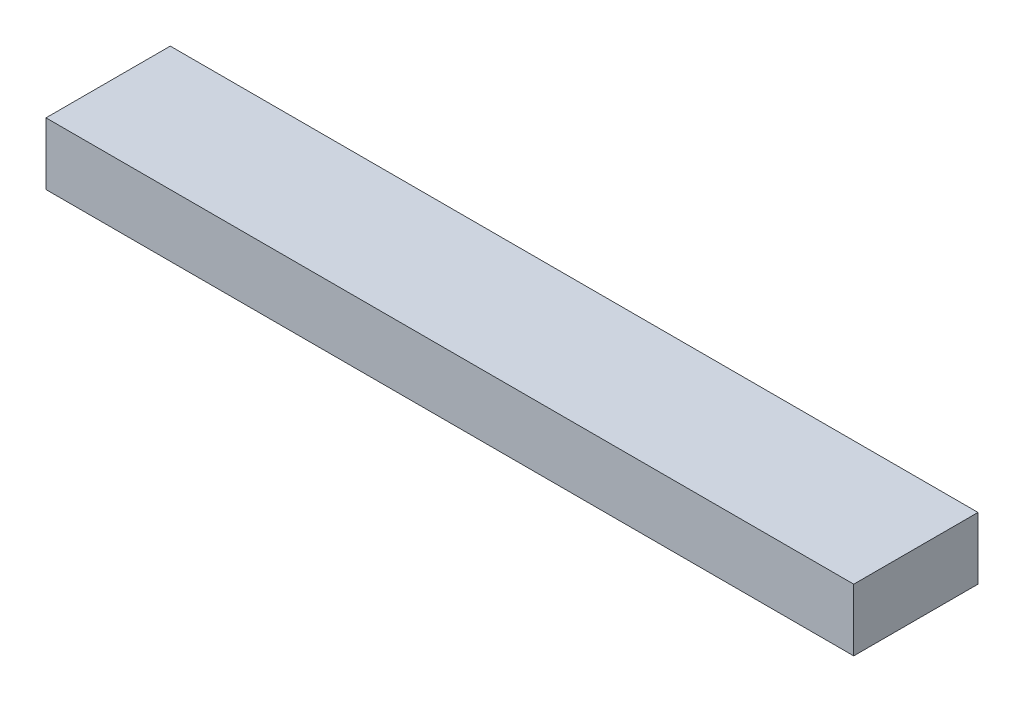
ISO-10303-21;
HEADER;
FILE_DESCRIPTION(('STEP AP214'),'2;1');
FILE_NAME('part.step','',(''),(''),'','','');
FILE_SCHEMA(('AUTOMOTIVE_DESIGN { 1 0 10303 214 1 1 1 1 }'));
ENDSEC;
DATA;
#1=APPLICATION_CONTEXT('core data for automotive mechanical design processes');
#2=APPLICATION_PROTOCOL_DEFINITION('international standard','automotive_design',2000,#1);
#3=PRODUCT_CONTEXT('',#1,'mechanical');
#4=PRODUCT('Part','Part','',(#3));
#5=PRODUCT_RELATED_PRODUCT_CATEGORY('part','',(#4));
#6=PRODUCT_DEFINITION_FORMATION('','',#4);
#7=PRODUCT_DEFINITION_CONTEXT('part definition',#1,'design');
#8=PRODUCT_DEFINITION('design','',#6,#7);
#9=PRODUCT_DEFINITION_SHAPE('','',#8);
#10=(LENGTH_UNIT() NAMED_UNIT(*) SI_UNIT(.MILLI.,.METRE.));
#11=(NAMED_UNIT(*) PLANE_ANGLE_UNIT() SI_UNIT($,.RADIAN.));
#12=(NAMED_UNIT(*) SI_UNIT($,.STERADIAN.) SOLID_ANGLE_UNIT());
#13=UNCERTAINTY_MEASURE_WITH_UNIT(LENGTH_MEASURE(1.E-05),#10,'distance_accuracy_value','');
#14=(GEOMETRIC_REPRESENTATION_CONTEXT(3) GLOBAL_UNCERTAINTY_ASSIGNED_CONTEXT((#13)) GLOBAL_UNIT_ASSIGNED_CONTEXT((#10,
#11,#12)) REPRESENTATION_CONTEXT('',''));
#15=CARTESIAN_POINT('',(0.,0.,0.));
#16=DIRECTION('',(0.,0.,1.));
#17=DIRECTION('',(1.,0.,0.));
#18=AXIS2_PLACEMENT_3D('',#15,#16,#17);
#19=CARTESIAN_POINT('',(32.5,5.,5.));
#20=DIRECTION('',(-1.,0.,0.));
#21=DIRECTION('',(0.,0.,1.));
#22=AXIS2_PLACEMENT_3D('',#19,#20,#21);
#23=PLANE('',#22);
#24=DIRECTION('',(0.,0.,-1.));
#25=VECTOR('',#24,1.);
#26=CARTESIAN_POINT('',(32.5,0.,5.));
#27=LINE('',#26,#25);
#28=CARTESIAN_POINT('',(32.5,0.,5.));
#29=VERTEX_POINT('',#28);
#30=CARTESIAN_POINT('',(32.5,0.,-5.));
#31=VERTEX_POINT('',#30);
#32=EDGE_CURVE('E96',#29,#31,#27,.T.);
#33=ORIENTED_EDGE('',*,*,#32,.T.);
#34=DIRECTION('',(0.,-1.,0.));
#35=VECTOR('',#34,1.);
#36=CARTESIAN_POINT('',(32.5,5.,-5.));
#37=LINE('',#36,#35);
#38=CARTESIAN_POINT('',(32.5,5.,-5.));
#39=VERTEX_POINT('',#38);
#40=EDGE_CURVE('E11',#39,#31,#37,.T.);
#41=ORIENTED_EDGE('',*,*,#40,.F.);
#42=DIRECTION('',(0.,0.,-1.));
#43=VECTOR('',#42,1.);
#44=CARTESIAN_POINT('',(32.5,5.,5.));
#45=LINE('',#44,#43);
#46=CARTESIAN_POINT('',(32.5,5.,5.));
#47=VERTEX_POINT('',#46);
#48=EDGE_CURVE('E84',#47,#39,#45,.T.);
#49=ORIENTED_EDGE('',*,*,#48,.F.);
#50=DIRECTION('',(0.,-1.,0.));
#51=VECTOR('',#50,1.);
#52=CARTESIAN_POINT('',(32.5,5.,5.));
#53=LINE('',#52,#51);
#54=EDGE_CURVE('E92',#47,#29,#53,.T.);
#55=ORIENTED_EDGE('',*,*,#54,.T.);
#56=EDGE_LOOP('',(#33,#41,#49,#55));
#57=FACE_BOUND('',#56,.T.);
#58=ADVANCED_FACE('F33',(#57),#23,.F.);
#59=CARTESIAN_POINT('',(-32.5,5.,-5.));
#60=DIRECTION('',(0.,0.,1.));
#61=DIRECTION('',(1.,0.,0.));
#62=AXIS2_PLACEMENT_3D('',#59,#60,#61);
#63=PLANE('',#62);
#64=DIRECTION('',(-1.,0.,0.));
#65=VECTOR('',#64,1.);
#66=CARTESIAN_POINT('',(-32.5,0.,-5.));
#67=LINE('',#66,#65);
#68=CARTESIAN_POINT('',(-32.5,0.,-5.));
#69=VERTEX_POINT('',#68);
#70=EDGE_CURVE('E88',#31,#69,#67,.T.);
#71=ORIENTED_EDGE('',*,*,#70,.T.);
#72=DIRECTION('',(0.,-1.,0.));
#73=VECTOR('',#72,1.);
#74=CARTESIAN_POINT('',(-32.5,5.,-5.));
#75=LINE('',#74,#73);
#76=CARTESIAN_POINT('',(-32.5,5.,-5.));
#77=VERTEX_POINT('',#76);
#78=EDGE_CURVE('E41',#77,#69,#75,.T.);
#79=ORIENTED_EDGE('',*,*,#78,.F.);
#80=DIRECTION('',(-1.,0.,0.));
#81=VECTOR('',#80,1.);
#82=CARTESIAN_POINT('',(-32.5,5.,-5.));
#83=LINE('',#82,#81);
#84=EDGE_CURVE('E79',#39,#77,#83,.T.);
#85=ORIENTED_EDGE('',*,*,#84,.F.);
#86=ORIENTED_EDGE('',*,*,#40,.T.);
#87=EDGE_LOOP('',(#71,#79,#85,#86));
#88=FACE_BOUND('',#87,.T.);
#89=ADVANCED_FACE('F87',(#88),#63,.F.);
#90=CARTESIAN_POINT('',(-32.5,5.,5.));
#91=DIRECTION('',(1.,0.,0.));
#92=DIRECTION('',(0.,0.,-1.));
#93=AXIS2_PLACEMENT_3D('',#90,#91,#92);
#94=PLANE('',#93);
#95=DIRECTION('',(0.,0.,1.));
#96=VECTOR('',#95,1.);
#97=CARTESIAN_POINT('',(-32.5,0.,5.));
#98=LINE('',#97,#96);
#99=CARTESIAN_POINT('',(-32.5,0.,5.));
#100=VERTEX_POINT('',#99);
#101=EDGE_CURVE('E66',#69,#100,#98,.T.);
#102=ORIENTED_EDGE('',*,*,#101,.T.);
#103=DIRECTION('',(0.,-1.,0.));
#104=VECTOR('',#103,1.);
#105=CARTESIAN_POINT('',(-32.5,5.,5.));
#106=LINE('',#105,#104);
#107=CARTESIAN_POINT('',(-32.5,5.,5.));
#108=VERTEX_POINT('',#107);
#109=EDGE_CURVE('E89',#108,#100,#106,.T.);
#110=ORIENTED_EDGE('',*,*,#109,.F.);
#111=DIRECTION('',(0.,0.,1.));
#112=VECTOR('',#111,1.);
#113=CARTESIAN_POINT('',(-32.5,5.,5.));
#114=LINE('',#113,#112);
#115=EDGE_CURVE('E82',#77,#108,#114,.T.);
#116=ORIENTED_EDGE('',*,*,#115,.F.);
#117=ORIENTED_EDGE('',*,*,#78,.T.);
#118=EDGE_LOOP('',(#102,#110,#116,#117));
#119=FACE_BOUND('',#118,.T.);
#120=ADVANCED_FACE('F90',(#119),#94,.F.);
#121=CARTESIAN_POINT('',(-32.5,5.,5.));
#122=DIRECTION('',(0.,0.,-1.));
#123=DIRECTION('',(-1.,0.,0.));
#124=AXIS2_PLACEMENT_3D('',#121,#122,#123);
#125=PLANE('',#124);
#126=DIRECTION('',(1.,0.,0.));
#127=VECTOR('',#126,1.);
#128=CARTESIAN_POINT('',(-32.5,0.,5.));
#129=LINE('',#128,#127);
#130=EDGE_CURVE('E72',#100,#29,#129,.T.);
#131=ORIENTED_EDGE('',*,*,#130,.T.);
#132=ORIENTED_EDGE('',*,*,#54,.F.);
#133=DIRECTION('',(1.,0.,0.));
#134=VECTOR('',#133,1.);
#135=CARTESIAN_POINT('',(-32.5,5.,5.));
#136=LINE('',#135,#134);
#137=EDGE_CURVE('E49',#108,#47,#136,.T.);
#138=ORIENTED_EDGE('',*,*,#137,.F.);
#139=ORIENTED_EDGE('',*,*,#109,.T.);
#140=EDGE_LOOP('',(#131,#132,#138,#139));
#141=FACE_BOUND('',#140,.T.);
#142=ADVANCED_FACE('F103',(#141),#125,.F.);
#143=CARTESIAN_POINT('',(0.,5.,0.));
#144=DIRECTION('',(0.,-1.,0.));
#145=DIRECTION('',(0.,0.,-1.));
#146=AXIS2_PLACEMENT_3D('',#143,#144,#145);
#147=PLANE('',#146);
#148=ORIENTED_EDGE('',*,*,#48,.T.);
#149=ORIENTED_EDGE('',*,*,#84,.T.);
#150=ORIENTED_EDGE('',*,*,#115,.T.);
#151=ORIENTED_EDGE('',*,*,#137,.T.);
#152=EDGE_LOOP('',(#148,#149,#150,#151));
#153=FACE_BOUND('',#152,.T.);
#154=ADVANCED_FACE('F80',(#153),#147,.F.);
#155=CARTESIAN_POINT('',(0.,0.,0.));
#156=DIRECTION('',(0.,-1.,0.));
#157=DIRECTION('',(0.,0.,-1.));
#158=AXIS2_PLACEMENT_3D('',#155,#156,#157);
#159=PLANE('',#158);
#160=ORIENTED_EDGE('',*,*,#32,.F.);
#161=ORIENTED_EDGE('',*,*,#130,.F.);
#162=ORIENTED_EDGE('',*,*,#101,.F.);
#163=ORIENTED_EDGE('',*,*,#70,.F.);
#164=EDGE_LOOP('',(#160,#161,#162,#163));
#165=FACE_BOUND('',#164,.T.);
#166=ADVANCED_FACE('F106',(#165),#159,.T.);
#167=CLOSED_SHELL('',(#58,#89,#120,#142,#154,#166));
#168=MANIFOLD_SOLID_BREP('B2',#167);
#169=ADVANCED_BREP_SHAPE_REPRESENTATION('',(#18,#168),#14);
#170=SHAPE_DEFINITION_REPRESENTATION(#9,#169);
ENDSEC;
END-ISO-10303-21;
